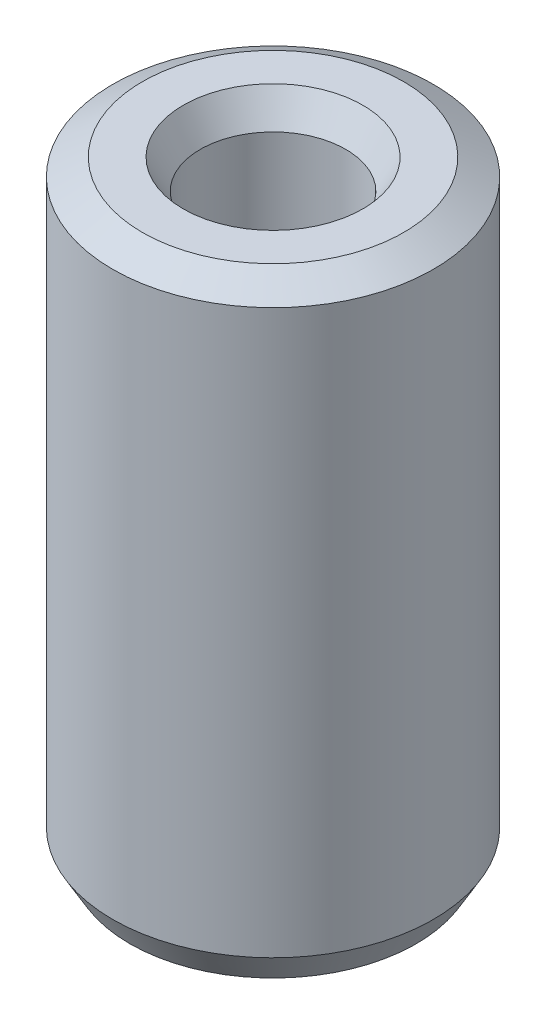
ISO-10303-21;
HEADER;
FILE_DESCRIPTION(('STEP AP214'),'2;1');
FILE_NAME('part.step','',(''),(''),'','','');
FILE_SCHEMA(('AUTOMOTIVE_DESIGN { 1 0 10303 214 1 1 1 1 }'));
ENDSEC;
DATA;
#1=APPLICATION_CONTEXT('core data for automotive mechanical design processes');
#2=APPLICATION_PROTOCOL_DEFINITION('international standard','automotive_design',2000,#1);
#3=PRODUCT_CONTEXT('',#1,'mechanical');
#4=PRODUCT('Part','Part','',(#3));
#5=PRODUCT_RELATED_PRODUCT_CATEGORY('part','',(#4));
#6=PRODUCT_DEFINITION_FORMATION('','',#4);
#7=PRODUCT_DEFINITION_CONTEXT('part definition',#1,'design');
#8=PRODUCT_DEFINITION('design','',#6,#7);
#9=PRODUCT_DEFINITION_SHAPE('','',#8);
#10=(LENGTH_UNIT() NAMED_UNIT(*) SI_UNIT(.MILLI.,.METRE.));
#11=(NAMED_UNIT(*) PLANE_ANGLE_UNIT() SI_UNIT($,.RADIAN.));
#12=(NAMED_UNIT(*) SI_UNIT($,.STERADIAN.) SOLID_ANGLE_UNIT());
#13=UNCERTAINTY_MEASURE_WITH_UNIT(LENGTH_MEASURE(1.E-05),#10,'distance_accuracy_value','');
#14=(GEOMETRIC_REPRESENTATION_CONTEXT(3) GLOBAL_UNCERTAINTY_ASSIGNED_CONTEXT((#13)) GLOBAL_UNIT_ASSIGNED_CONTEXT((#10,
#11,#12)) REPRESENTATION_CONTEXT('',''));
#15=CARTESIAN_POINT('',(0.,0.,0.));
#16=DIRECTION('',(0.,0.,1.));
#17=DIRECTION('',(1.,0.,0.));
#18=AXIS2_PLACEMENT_3D('',#15,#16,#17);
#19=CARTESIAN_POINT('',(0.,57.058999028677,0.));
#20=DIRECTION('',(0.,-1.,0.));
#21=DIRECTION('',(0.,0.,-1.));
#22=AXIS2_PLACEMENT_3D('',#19,#20,#21);
#23=CYLINDRICAL_SURFACE('',#22,15.);
#24=CARTESIAN_POINT('',(0.,2.77372681550449,0.));
#25=DIRECTION('',(0.,1.,0.));
#26=DIRECTION('',(0.,0.,1.));
#27=AXIS2_PLACEMENT_3D('',#24,#25,#26);
#28=CIRCLE('',#27,15.);
#29=CARTESIAN_POINT('',(0.,2.77372681550449,15.));
#30=VERTEX_POINT('',#29);
#31=EDGE_CURVE('E10',#30,#30,#28,.T.);
#32=ORIENTED_EDGE('',*,*,#31,.T.);
#33=EDGE_LOOP('',(#32));
#34=FACE_BOUND('',#33,.T.);
#35=CARTESIAN_POINT('',(0.,55.457587105087,0.));
#36=DIRECTION('',(0.,1.,0.));
#37=DIRECTION('',(0.,0.,1.));
#38=AXIS2_PLACEMENT_3D('',#35,#36,#37);
#39=CIRCLE('',#38,15.);
#40=CARTESIAN_POINT('',(0.,55.457587105087,15.));
#41=VERTEX_POINT('',#40);
#42=EDGE_CURVE('E50',#41,#41,#39,.F.);
#43=ORIENTED_EDGE('',*,*,#42,.T.);
#44=EDGE_LOOP('',(#43));
#45=FACE_BOUND('',#44,.T.);
#46=ADVANCED_FACE('F39',(#34,#45),#23,.T.);
#47=CARTESIAN_POINT('',(0.,57.058999028677,0.));
#48=DIRECTION('',(0.,1.,0.));
#49=DIRECTION('',(0.,0.,1.));
#50=AXIS2_PLACEMENT_3D('',#47,#48,#49);
#51=PLANE('',#50);
#52=CARTESIAN_POINT('',(0.,57.058999028677,0.));
#53=DIRECTION('',(0.,1.,0.));
#54=DIRECTION('',(0.,0.,1.));
#55=AXIS2_PLACEMENT_3D('',#52,#53,#54);
#56=CIRCLE('',#55,8.40679266466);
#57=CARTESIAN_POINT('',(0.,57.058999028677,8.40679266466));
#58=VERTEX_POINT('',#57);
#59=EDGE_CURVE('E58',#58,#58,#56,.F.);
#60=ORIENTED_EDGE('',*,*,#59,.T.);
#61=EDGE_LOOP('',(#60));
#62=FACE_BOUND('',#61,.T.);
#63=CARTESIAN_POINT('',(0.,57.058999028677,0.));
#64=DIRECTION('',(0.,1.,0.));
#65=DIRECTION('',(0.,0.,1.));
#66=AXIS2_PLACEMENT_3D('',#63,#64,#65);
#67=CIRCLE('',#66,12.2262731844956);
#68=CARTESIAN_POINT('',(0.,57.058999028677,12.2262731844956));
#69=VERTEX_POINT('',#68);
#70=EDGE_CURVE('E61',#69,#69,#67,.T.);
#71=ORIENTED_EDGE('',*,*,#70,.T.);
#72=EDGE_LOOP('',(#71));
#73=FACE_BOUND('',#72,.T.);
#74=ADVANCED_FACE('F88',(#62,#73),#51,.T.);
#75=CARTESIAN_POINT('',(0.,0.,0.));
#76=DIRECTION('',(0.,1.,0.));
#77=DIRECTION('',(0.,0.,1.));
#78=AXIS2_PLACEMENT_3D('',#75,#76,#77);
#79=PLANE('',#78);
#80=CARTESIAN_POINT('',(0.,0.,0.));
#81=DIRECTION('',(0.,1.,0.));
#82=DIRECTION('',(0.,0.,1.));
#83=AXIS2_PLACEMENT_3D('',#80,#81,#82);
#84=CIRCLE('',#83,9.57910755657448);
#85=CARTESIAN_POINT('',(0.,0.,9.57910755657448));
#86=VERTEX_POINT('',#85);
#87=EDGE_CURVE('E51',#86,#86,#84,.T.);
#88=ORIENTED_EDGE('',*,*,#87,.T.);
#89=EDGE_LOOP('',(#88));
#90=FACE_BOUND('',#89,.T.);
#91=CARTESIAN_POINT('',(0.,0.,0.));
#92=DIRECTION('',(0.,1.,0.));
#93=DIRECTION('',(0.,0.,1.));
#94=AXIS2_PLACEMENT_3D('',#91,#92,#93);
#95=CIRCLE('',#94,13.39858807641);
#96=CARTESIAN_POINT('',(0.,0.,13.39858807641));
#97=VERTEX_POINT('',#96);
#98=EDGE_CURVE('E54',#97,#97,#95,.F.);
#99=ORIENTED_EDGE('',*,*,#98,.T.);
#100=EDGE_LOOP('',(#99));
#101=FACE_BOUND('',#100,.T.);
#102=ADVANCED_FACE('F83',(#90,#101),#79,.F.);
#103=CARTESIAN_POINT('',(0.,57.058999028677,0.));
#104=DIRECTION('',(0.,-1.,0.));
#105=DIRECTION('',(0.,0.,-1.));
#106=AXIS2_PLACEMENT_3D('',#103,#104,#105);
#107=CYLINDRICAL_SURFACE('',#106,6.80538074107);
#108=CARTESIAN_POINT('',(0.,54.2852722131725,0.));
#109=DIRECTION('',(0.,1.,0.));
#110=DIRECTION('',(0.,0.,1.));
#111=AXIS2_PLACEMENT_3D('',#108,#109,#110);
#112=CIRCLE('',#111,6.80538074107);
#113=CARTESIAN_POINT('',(0.,54.2852722131725,6.80538074107));
#114=VERTEX_POINT('',#113);
#115=EDGE_CURVE('E67',#114,#114,#112,.T.);
#116=ORIENTED_EDGE('',*,*,#115,.T.);
#117=EDGE_LOOP('',(#116));
#118=FACE_BOUND('',#117,.T.);
#119=CARTESIAN_POINT('',(0.,1.60141192359001,0.));
#120=DIRECTION('',(0.,1.,0.));
#121=DIRECTION('',(0.,0.,1.));
#122=AXIS2_PLACEMENT_3D('',#119,#120,#121);
#123=CIRCLE('',#122,6.80538074107);
#124=CARTESIAN_POINT('',(0.,1.60141192359001,6.80538074107));
#125=VERTEX_POINT('',#124);
#126=EDGE_CURVE('E69',#125,#125,#123,.F.);
#127=ORIENTED_EDGE('',*,*,#126,.T.);
#128=EDGE_LOOP('',(#127));
#129=FACE_BOUND('',#128,.T.);
#130=ADVANCED_FACE('F71',(#118,#129),#107,.F.);
#131=CARTESIAN_POINT('',(0.,54.2852722131725,0.));
#132=DIRECTION('',(0.,1.,0.));
#133=DIRECTION('',(0.,0.,1.));
#134=AXIS2_PLACEMENT_3D('',#131,#132,#133);
#135=CONICAL_SURFACE('',#134,6.80538074107,0.523598775598302);
#136=ORIENTED_EDGE('',*,*,#59,.F.);
#137=EDGE_LOOP('',(#136));
#138=FACE_BOUND('',#137,.T.);
#139=ORIENTED_EDGE('',*,*,#115,.F.);
#140=EDGE_LOOP('',(#139));
#141=FACE_BOUND('',#140,.T.);
#142=ADVANCED_FACE('F77',(#138,#141),#135,.F.);
#143=CARTESIAN_POINT('',(0.,0.,0.));
#144=DIRECTION('',(0.,-1.,0.));
#145=DIRECTION('',(0.,0.,-1.));
#146=AXIS2_PLACEMENT_3D('',#143,#144,#145);
#147=CONICAL_SURFACE('',#146,9.57910755657448,1.04719755119659);
#148=ORIENTED_EDGE('',*,*,#126,.F.);
#149=EDGE_LOOP('',(#148));
#150=FACE_BOUND('',#149,.T.);
#151=ORIENTED_EDGE('',*,*,#87,.F.);
#152=EDGE_LOOP('',(#151));
#153=FACE_BOUND('',#152,.T.);
#154=ADVANCED_FACE('F73',(#150,#153),#147,.F.);
#155=CARTESIAN_POINT('',(0.,2.77372681550449,0.));
#156=DIRECTION('',(0.,1.,0.));
#157=DIRECTION('',(0.,0.,1.));
#158=AXIS2_PLACEMENT_3D('',#155,#156,#157);
#159=CONICAL_SURFACE('',#158,15.,0.523598775598303);
#160=ORIENTED_EDGE('',*,*,#98,.F.);
#161=EDGE_LOOP('',(#160));
#162=FACE_BOUND('',#161,.T.);
#163=ORIENTED_EDGE('',*,*,#31,.F.);
#164=EDGE_LOOP('',(#163));
#165=FACE_BOUND('',#164,.T.);
#166=ADVANCED_FACE('F76',(#162,#165),#159,.T.);
#167=CARTESIAN_POINT('',(0.,57.058999028677,0.));
#168=DIRECTION('',(0.,-1.,0.));
#169=DIRECTION('',(0.,0.,-1.));
#170=AXIS2_PLACEMENT_3D('',#167,#168,#169);
#171=CONICAL_SURFACE('',#170,12.2262731844956,1.04719755119659);
#172=ORIENTED_EDGE('',*,*,#42,.F.);
#173=EDGE_LOOP('',(#172));
#174=FACE_BOUND('',#173,.T.);
#175=ORIENTED_EDGE('',*,*,#70,.F.);
#176=EDGE_LOOP('',(#175));
#177=FACE_BOUND('',#176,.T.);
#178=ADVANCED_FACE('F45',(#174,#177),#171,.T.);
#179=CLOSED_SHELL('',(#46,#74,#102,#130,#142,#154,#166,#178));
#180=MANIFOLD_SOLID_BREP('B2',#179);
#181=ADVANCED_BREP_SHAPE_REPRESENTATION('',(#18,#180),#14);
#182=SHAPE_DEFINITION_REPRESENTATION(#9,#181);
ENDSEC;
END-ISO-10303-21;
